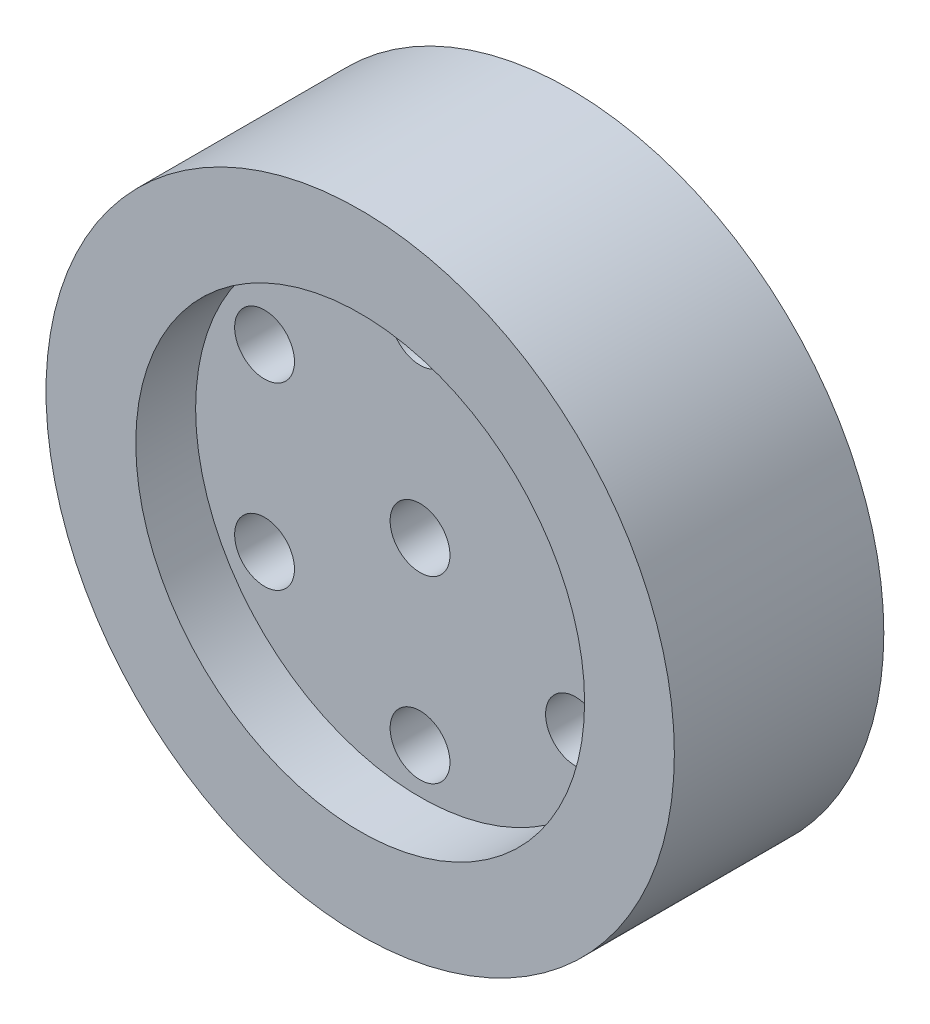
ISO-10303-21;
HEADER;
FILE_DESCRIPTION(('STEP AP214'),'2;1');
FILE_NAME('part.step','',(''),(''),'','','');
FILE_SCHEMA(('AUTOMOTIVE_DESIGN { 1 0 10303 214 1 1 1 1 }'));
ENDSEC;
DATA;
#1=APPLICATION_CONTEXT('core data for automotive mechanical design processes');
#2=APPLICATION_PROTOCOL_DEFINITION('international standard','automotive_design',2000,#1);
#3=PRODUCT_CONTEXT('',#1,'mechanical');
#4=PRODUCT('Part','Part','',(#3));
#5=PRODUCT_RELATED_PRODUCT_CATEGORY('part','',(#4));
#6=PRODUCT_DEFINITION_FORMATION('','',#4);
#7=PRODUCT_DEFINITION_CONTEXT('part definition',#1,'design');
#8=PRODUCT_DEFINITION('design','',#6,#7);
#9=PRODUCT_DEFINITION_SHAPE('','',#8);
#10=(LENGTH_UNIT() NAMED_UNIT(*) SI_UNIT(.MILLI.,.METRE.));
#11=(NAMED_UNIT(*) PLANE_ANGLE_UNIT() SI_UNIT($,.RADIAN.));
#12=(NAMED_UNIT(*) SI_UNIT($,.STERADIAN.) SOLID_ANGLE_UNIT());
#13=UNCERTAINTY_MEASURE_WITH_UNIT(LENGTH_MEASURE(1.E-05),#10,'distance_accuracy_value','');
#14=(GEOMETRIC_REPRESENTATION_CONTEXT(3) GLOBAL_UNCERTAINTY_ASSIGNED_CONTEXT((#13)) GLOBAL_UNIT_ASSIGNED_CONTEXT((#10,
#11,#12)) REPRESENTATION_CONTEXT('',''));
#15=CARTESIAN_POINT('',(0.,0.,0.));
#16=DIRECTION('',(0.,0.,1.));
#17=DIRECTION('',(1.,0.,0.));
#18=AXIS2_PLACEMENT_3D('',#15,#16,#17);
#19=CARTESIAN_POINT('',(0.,12.,14.));
#20=DIRECTION('',(0.,0.,-1.));
#21=DIRECTION('',(-1.,0.,0.));
#22=AXIS2_PLACEMENT_3D('',#19,#20,#21);
#23=CYLINDRICAL_SURFACE('',#22,2.);
#24=CARTESIAN_POINT('',(0.,12.,10.));
#25=DIRECTION('',(0.,0.,1.));
#26=DIRECTION('',(1.,0.,0.));
#27=AXIS2_PLACEMENT_3D('',#24,#25,#26);
#28=CIRCLE('',#27,2.);
#29=CARTESIAN_POINT('',(2.,12.,10.));
#30=VERTEX_POINT('',#29);
#31=EDGE_CURVE('E82',#30,#30,#28,.T.);
#32=ORIENTED_EDGE('',*,*,#31,.T.);
#33=EDGE_LOOP('',(#32));
#34=FACE_BOUND('',#33,.T.);
#35=CARTESIAN_POINT('',(0.,12.,4.));
#36=DIRECTION('',(0.,0.,-1.));
#37=DIRECTION('',(-1.,0.,0.));
#38=AXIS2_PLACEMENT_3D('',#35,#36,#37);
#39=CIRCLE('',#38,2.);
#40=CARTESIAN_POINT('',(-2.,12.,4.));
#41=VERTEX_POINT('',#40);
#42=EDGE_CURVE('E67',#41,#41,#39,.T.);
#43=ORIENTED_EDGE('',*,*,#42,.T.);
#44=EDGE_LOOP('',(#43));
#45=FACE_BOUND('',#44,.T.);
#46=ADVANCED_FACE('F35',(#34,#45),#23,.F.);
#47=CARTESIAN_POINT('',(10.3923048454133,5.99999999999998,14.));
#48=DIRECTION('',(0.,0.,-1.));
#49=DIRECTION('',(-1.,0.,0.));
#50=AXIS2_PLACEMENT_3D('',#47,#48,#49);
#51=CYLINDRICAL_SURFACE('',#50,2.);
#52=CARTESIAN_POINT('',(10.3923048454133,5.99999999999998,10.));
#53=DIRECTION('',(0.,0.,1.));
#54=DIRECTION('',(1.,0.,0.));
#55=AXIS2_PLACEMENT_3D('',#52,#53,#54);
#56=CIRCLE('',#55,2.);
#57=CARTESIAN_POINT('',(12.3923048454133,5.99999999999998,10.));
#58=VERTEX_POINT('',#57);
#59=EDGE_CURVE('E77',#58,#58,#56,.T.);
#60=ORIENTED_EDGE('',*,*,#59,.T.);
#61=EDGE_LOOP('',(#60));
#62=FACE_BOUND('',#61,.T.);
#63=CARTESIAN_POINT('',(10.3923048454133,5.99999999999998,4.));
#64=DIRECTION('',(0.,0.,-1.));
#65=DIRECTION('',(-1.,0.,0.));
#66=AXIS2_PLACEMENT_3D('',#63,#64,#65);
#67=CIRCLE('',#66,2.);
#68=CARTESIAN_POINT('',(8.39230484541328,5.99999999999998,4.));
#69=VERTEX_POINT('',#68);
#70=EDGE_CURVE('E137',#69,#69,#67,.T.);
#71=ORIENTED_EDGE('',*,*,#70,.T.);
#72=EDGE_LOOP('',(#71));
#73=FACE_BOUND('',#72,.T.);
#74=ADVANCED_FACE('F184',(#62,#73),#51,.F.);
#75=CARTESIAN_POINT('',(10.3923048454132,-6.00000000000005,14.));
#76=DIRECTION('',(0.,0.,-1.));
#77=DIRECTION('',(-1.,0.,0.));
#78=AXIS2_PLACEMENT_3D('',#75,#76,#77);
#79=CYLINDRICAL_SURFACE('',#78,2.);
#80=CARTESIAN_POINT('',(10.3923048454132,-6.00000000000005,10.));
#81=DIRECTION('',(0.,0.,1.));
#82=DIRECTION('',(1.,0.,0.));
#83=AXIS2_PLACEMENT_3D('',#80,#81,#82);
#84=CIRCLE('',#83,2.);
#85=CARTESIAN_POINT('',(12.3923048454132,-6.00000000000005,10.));
#86=VERTEX_POINT('',#85);
#87=EDGE_CURVE('E74',#86,#86,#84,.T.);
#88=ORIENTED_EDGE('',*,*,#87,.T.);
#89=EDGE_LOOP('',(#88));
#90=FACE_BOUND('',#89,.T.);
#91=CARTESIAN_POINT('',(10.3923048454132,-6.00000000000005,4.));
#92=DIRECTION('',(0.,0.,-1.));
#93=DIRECTION('',(-1.,0.,0.));
#94=AXIS2_PLACEMENT_3D('',#91,#92,#93);
#95=CIRCLE('',#94,2.);
#96=CARTESIAN_POINT('',(8.39230484541324,-6.00000000000005,4.));
#97=VERTEX_POINT('',#96);
#98=EDGE_CURVE('E128',#97,#97,#95,.T.);
#99=ORIENTED_EDGE('',*,*,#98,.T.);
#100=EDGE_LOOP('',(#99));
#101=FACE_BOUND('',#100,.T.);
#102=ADVANCED_FACE('F189',(#90,#101),#79,.F.);
#103=CARTESIAN_POINT('',(0.,-12.,14.));
#104=DIRECTION('',(0.,0.,-1.));
#105=DIRECTION('',(-1.,0.,0.));
#106=AXIS2_PLACEMENT_3D('',#103,#104,#105);
#107=CYLINDRICAL_SURFACE('',#106,2.);
#108=CARTESIAN_POINT('',(0.,-12.,10.));
#109=DIRECTION('',(0.,0.,1.));
#110=DIRECTION('',(1.,0.,0.));
#111=AXIS2_PLACEMENT_3D('',#108,#109,#110);
#112=CIRCLE('',#111,2.);
#113=CARTESIAN_POINT('',(1.99999999999992,-12.,10.));
#114=VERTEX_POINT('',#113);
#115=EDGE_CURVE('E59',#114,#114,#112,.T.);
#116=ORIENTED_EDGE('',*,*,#115,.T.);
#117=EDGE_LOOP('',(#116));
#118=FACE_BOUND('',#117,.T.);
#119=CARTESIAN_POINT('',(0.,-12.,4.));
#120=DIRECTION('',(0.,0.,-1.));
#121=DIRECTION('',(-1.,0.,0.));
#122=AXIS2_PLACEMENT_3D('',#119,#120,#121);
#123=CIRCLE('',#122,2.);
#124=CARTESIAN_POINT('',(-2.00000000000008,-12.,4.));
#125=VERTEX_POINT('',#124);
#126=EDGE_CURVE('E125',#125,#125,#123,.T.);
#127=ORIENTED_EDGE('',*,*,#126,.T.);
#128=EDGE_LOOP('',(#127));
#129=FACE_BOUND('',#128,.T.);
#130=ADVANCED_FACE('F119',(#118,#129),#107,.F.);
#131=CARTESIAN_POINT('',(-10.3923048454133,-5.99999999999991,14.));
#132=DIRECTION('',(0.,0.,-1.));
#133=DIRECTION('',(-1.,0.,0.));
#134=AXIS2_PLACEMENT_3D('',#131,#132,#133);
#135=CYLINDRICAL_SURFACE('',#134,2.);
#136=CARTESIAN_POINT('',(-10.3923048454133,-5.99999999999991,10.));
#137=DIRECTION('',(0.,0.,1.));
#138=DIRECTION('',(1.,0.,0.));
#139=AXIS2_PLACEMENT_3D('',#136,#137,#138);
#140=CIRCLE('',#139,2.);
#141=CARTESIAN_POINT('',(-8.39230484541332,-5.99999999999991,10.));
#142=VERTEX_POINT('',#141);
#143=EDGE_CURVE('E54',#142,#142,#140,.T.);
#144=ORIENTED_EDGE('',*,*,#143,.T.);
#145=EDGE_LOOP('',(#144));
#146=FACE_BOUND('',#145,.T.);
#147=CARTESIAN_POINT('',(-10.3923048454133,-5.99999999999991,4.));
#148=DIRECTION('',(0.,0.,-1.));
#149=DIRECTION('',(-1.,0.,0.));
#150=AXIS2_PLACEMENT_3D('',#147,#148,#149);
#151=CIRCLE('',#150,2.);
#152=CARTESIAN_POINT('',(-12.3923048454133,-5.99999999999991,4.));
#153=VERTEX_POINT('',#152);
#154=EDGE_CURVE('E123',#153,#153,#151,.T.);
#155=ORIENTED_EDGE('',*,*,#154,.T.);
#156=EDGE_LOOP('',(#155));
#157=FACE_BOUND('',#156,.T.);
#158=ADVANCED_FACE('F115',(#146,#157),#135,.F.);
#159=CARTESIAN_POINT('',(-10.3923048454132,6.00000000000012,14.));
#160=DIRECTION('',(0.,0.,-1.));
#161=DIRECTION('',(-1.,0.,0.));
#162=AXIS2_PLACEMENT_3D('',#159,#160,#161);
#163=CYLINDRICAL_SURFACE('',#162,2.);
#164=CARTESIAN_POINT('',(-10.3923048454132,6.00000000000012,10.));
#165=DIRECTION('',(0.,0.,1.));
#166=DIRECTION('',(1.,0.,0.));
#167=AXIS2_PLACEMENT_3D('',#164,#165,#166);
#168=CIRCLE('',#167,2.);
#169=CARTESIAN_POINT('',(-8.3923048454132,6.00000000000012,10.));
#170=VERTEX_POINT('',#169);
#171=EDGE_CURVE('E52',#170,#170,#168,.T.);
#172=ORIENTED_EDGE('',*,*,#171,.T.);
#173=EDGE_LOOP('',(#172));
#174=FACE_BOUND('',#173,.T.);
#175=CARTESIAN_POINT('',(-10.3923048454132,6.00000000000012,4.));
#176=DIRECTION('',(0.,0.,-1.));
#177=DIRECTION('',(-1.,0.,0.));
#178=AXIS2_PLACEMENT_3D('',#175,#176,#177);
#179=CIRCLE('',#178,2.);
#180=CARTESIAN_POINT('',(-12.3923048454132,6.00000000000012,4.));
#181=VERTEX_POINT('',#180);
#182=EDGE_CURVE('E39',#181,#181,#179,.T.);
#183=ORIENTED_EDGE('',*,*,#182,.T.);
#184=EDGE_LOOP('',(#183));
#185=FACE_BOUND('',#184,.T.);
#186=ADVANCED_FACE('F118',(#174,#185),#163,.F.);
#187=CARTESIAN_POINT('',(0.,0.,0.));
#188=DIRECTION('',(0.,0.,1.));
#189=DIRECTION('',(1.,0.,0.));
#190=AXIS2_PLACEMENT_3D('',#187,#188,#189);
#191=PLANE('',#190);
#192=CARTESIAN_POINT('',(0.,0.,0.));
#193=DIRECTION('',(0.,0.,1.));
#194=DIRECTION('',(1.,0.,0.));
#195=AXIS2_PLACEMENT_3D('',#192,#193,#194);
#196=CIRCLE('',#195,2.);
#197=CARTESIAN_POINT('',(2.,0.,0.));
#198=VERTEX_POINT('',#197);
#199=EDGE_CURVE('E48',#198,#198,#196,.T.);
#200=ORIENTED_EDGE('',*,*,#199,.T.);
#201=EDGE_LOOP('',(#200));
#202=FACE_BOUND('',#201,.T.);
#203=CARTESIAN_POINT('',(0.,0.,0.));
#204=DIRECTION('',(0.,0.,-1.));
#205=DIRECTION('',(-1.,0.,0.));
#206=AXIS2_PLACEMENT_3D('',#203,#204,#205);
#207=CIRCLE('',#206,5.);
#208=CARTESIAN_POINT('',(-5.,0.,0.));
#209=VERTEX_POINT('',#208);
#210=EDGE_CURVE('E166',#209,#209,#207,.T.);
#211=ORIENTED_EDGE('',*,*,#210,.T.);
#212=EDGE_LOOP('',(#211));
#213=FACE_BOUND('',#212,.T.);
#214=ADVANCED_FACE('F89',(#202,#213),#191,.F.);
#215=CARTESIAN_POINT('',(0.,0.,14.));
#216=DIRECTION('',(0.,0.,-1.));
#217=DIRECTION('',(-1.,0.,0.));
#218=AXIS2_PLACEMENT_3D('',#215,#216,#217);
#219=CYLINDRICAL_SURFACE('',#218,2.);
#220=ORIENTED_EDGE('',*,*,#199,.F.);
#221=EDGE_LOOP('',(#220));
#222=FACE_BOUND('',#221,.T.);
#223=CARTESIAN_POINT('',(0.,0.,10.));
#224=DIRECTION('',(0.,0.,1.));
#225=DIRECTION('',(1.,0.,0.));
#226=AXIS2_PLACEMENT_3D('',#223,#224,#225);
#227=CIRCLE('',#226,2.);
#228=CARTESIAN_POINT('',(2.,0.,10.));
#229=VERTEX_POINT('',#228);
#230=EDGE_CURVE('E80',#229,#229,#227,.T.);
#231=ORIENTED_EDGE('',*,*,#230,.T.);
#232=EDGE_LOOP('',(#231));
#233=FACE_BOUND('',#232,.T.);
#234=ADVANCED_FACE('F92',(#222,#233),#219,.F.);
#235=CARTESIAN_POINT('',(0.,0.,14.));
#236=DIRECTION('',(0.,0.,1.));
#237=DIRECTION('',(1.,0.,0.));
#238=AXIS2_PLACEMENT_3D('',#235,#236,#237);
#239=PLANE('',#238);
#240=CARTESIAN_POINT('',(0.,0.,14.));
#241=DIRECTION('',(0.,0.,1.));
#242=DIRECTION('',(1.,0.,0.));
#243=AXIS2_PLACEMENT_3D('',#240,#241,#242);
#244=CIRCLE('',#243,15.);
#245=CARTESIAN_POINT('',(15.,0.,14.));
#246=VERTEX_POINT('',#245);
#247=EDGE_CURVE('E62',#246,#246,#244,.T.);
#248=ORIENTED_EDGE('',*,*,#247,.F.);
#249=EDGE_LOOP('',(#248));
#250=FACE_BOUND('',#249,.T.);
#251=CARTESIAN_POINT('',(0.,0.,14.));
#252=DIRECTION('',(0.,0.,1.));
#253=DIRECTION('',(1.,0.,0.));
#254=AXIS2_PLACEMENT_3D('',#251,#252,#253);
#255=CIRCLE('',#254,21.);
#256=CARTESIAN_POINT('',(21.,0.,14.));
#257=VERTEX_POINT('',#256);
#258=EDGE_CURVE('E10',#257,#257,#255,.T.);
#259=ORIENTED_EDGE('',*,*,#258,.T.);
#260=EDGE_LOOP('',(#259));
#261=FACE_BOUND('',#260,.T.);
#262=ADVANCED_FACE('F95',(#250,#261),#239,.T.);
#263=CARTESIAN_POINT('',(0.,0.,0.));
#264=DIRECTION('',(0.,0.,-1.));
#265=DIRECTION('',(-1.,0.,0.));
#266=AXIS2_PLACEMENT_3D('',#263,#264,#265);
#267=CIRCLE('',#266,15.);
#268=CARTESIAN_POINT('',(-15.,0.,0.));
#269=VERTEX_POINT('',#268);
#270=EDGE_CURVE('E133',#269,#269,#267,.T.);
#271=ORIENTED_EDGE('',*,*,#270,.F.);
#272=EDGE_LOOP('',(#271));
#273=FACE_BOUND('',#272,.T.);
#274=CARTESIAN_POINT('',(0.,0.,0.));
#275=DIRECTION('',(0.,0.,1.));
#276=DIRECTION('',(1.,0.,0.));
#277=AXIS2_PLACEMENT_3D('',#274,#275,#276);
#278=CIRCLE('',#277,21.);
#279=CARTESIAN_POINT('',(21.,0.,0.));
#280=VERTEX_POINT('',#279);
#281=EDGE_CURVE('E43',#280,#280,#278,.T.);
#282=ORIENTED_EDGE('',*,*,#281,.F.);
#283=EDGE_LOOP('',(#282));
#284=FACE_BOUND('',#283,.T.);
#285=ADVANCED_FACE('F175',(#273,#284),#191,.F.);
#286=CARTESIAN_POINT('',(0.,0.,14.));
#287=DIRECTION('',(0.,0.,-1.));
#288=DIRECTION('',(-1.,0.,0.));
#289=AXIS2_PLACEMENT_3D('',#286,#287,#288);
#290=CYLINDRICAL_SURFACE('',#289,21.);
#291=ORIENTED_EDGE('',*,*,#258,.F.);
#292=EDGE_LOOP('',(#291));
#293=FACE_BOUND('',#292,.T.);
#294=ORIENTED_EDGE('',*,*,#281,.T.);
#295=EDGE_LOOP('',(#294));
#296=FACE_BOUND('',#295,.T.);
#297=ADVANCED_FACE('F37',(#293,#296),#290,.T.);
#298=CARTESIAN_POINT('',(0.,0.,10.));
#299=DIRECTION('',(0.,0.,1.));
#300=DIRECTION('',(1.,0.,0.));
#301=AXIS2_PLACEMENT_3D('',#298,#299,#300);
#302=CYLINDRICAL_SURFACE('',#301,15.);
#303=CARTESIAN_POINT('',(0.,0.,10.));
#304=DIRECTION('',(0.,0.,1.));
#305=DIRECTION('',(1.,0.,0.));
#306=AXIS2_PLACEMENT_3D('',#303,#304,#305);
#307=CIRCLE('',#306,15.);
#308=CARTESIAN_POINT('',(15.,0.,10.));
#309=VERTEX_POINT('',#308);
#310=EDGE_CURVE('E55',#309,#309,#307,.T.);
#311=ORIENTED_EDGE('',*,*,#310,.F.);
#312=EDGE_LOOP('',(#311));
#313=FACE_BOUND('',#312,.T.);
#314=ORIENTED_EDGE('',*,*,#247,.T.);
#315=EDGE_LOOP('',(#314));
#316=FACE_BOUND('',#315,.T.);
#317=ADVANCED_FACE('F103',(#313,#316),#302,.F.);
#318=CARTESIAN_POINT('',(0.,0.,10.));
#319=DIRECTION('',(0.,0.,1.));
#320=DIRECTION('',(1.,0.,0.));
#321=AXIS2_PLACEMENT_3D('',#318,#319,#320);
#322=PLANE('',#321);
#323=ORIENTED_EDGE('',*,*,#31,.F.);
#324=EDGE_LOOP('',(#323));
#325=FACE_BOUND('',#324,.T.);
#326=ORIENTED_EDGE('',*,*,#230,.F.);
#327=EDGE_LOOP('',(#326));
#328=FACE_BOUND('',#327,.T.);
#329=ORIENTED_EDGE('',*,*,#59,.F.);
#330=EDGE_LOOP('',(#329));
#331=FACE_BOUND('',#330,.T.);
#332=ORIENTED_EDGE('',*,*,#87,.F.);
#333=EDGE_LOOP('',(#332));
#334=FACE_BOUND('',#333,.T.);
#335=ORIENTED_EDGE('',*,*,#115,.F.);
#336=EDGE_LOOP('',(#335));
#337=FACE_BOUND('',#336,.T.);
#338=ORIENTED_EDGE('',*,*,#143,.F.);
#339=EDGE_LOOP('',(#338));
#340=FACE_BOUND('',#339,.T.);
#341=ORIENTED_EDGE('',*,*,#171,.F.);
#342=EDGE_LOOP('',(#341));
#343=FACE_BOUND('',#342,.T.);
#344=ORIENTED_EDGE('',*,*,#310,.T.);
#345=EDGE_LOOP('',(#344));
#346=FACE_BOUND('',#345,.T.);
#347=ADVANCED_FACE('F99',(#325,#328,#331,#334,#337,#340,#343,#346),#322,.T.);
#348=CARTESIAN_POINT('',(0.,0.,4.));
#349=DIRECTION('',(0.,0.,-1.));
#350=DIRECTION('',(-1.,0.,0.));
#351=AXIS2_PLACEMENT_3D('',#348,#349,#350);
#352=CYLINDRICAL_SURFACE('',#351,15.);
#353=CARTESIAN_POINT('',(0.,0.,4.));
#354=DIRECTION('',(0.,0.,-1.));
#355=DIRECTION('',(-1.,0.,0.));
#356=AXIS2_PLACEMENT_3D('',#353,#354,#355);
#357=CIRCLE('',#356,15.);
#358=CARTESIAN_POINT('',(-15.,0.,4.));
#359=VERTEX_POINT('',#358);
#360=EDGE_CURVE('E131',#359,#359,#357,.T.);
#361=ORIENTED_EDGE('',*,*,#360,.F.);
#362=EDGE_LOOP('',(#361));
#363=FACE_BOUND('',#362,.T.);
#364=ORIENTED_EDGE('',*,*,#270,.T.);
#365=EDGE_LOOP('',(#364));
#366=FACE_BOUND('',#365,.T.);
#367=ADVANCED_FACE('F102',(#363,#366),#352,.F.);
#368=CARTESIAN_POINT('',(0.,0.,4.));
#369=DIRECTION('',(0.,0.,-1.));
#370=DIRECTION('',(-1.,0.,0.));
#371=AXIS2_PLACEMENT_3D('',#368,#369,#370);
#372=PLANE('',#371);
#373=ORIENTED_EDGE('',*,*,#42,.F.);
#374=EDGE_LOOP('',(#373));
#375=FACE_BOUND('',#374,.T.);
#376=ORIENTED_EDGE('',*,*,#70,.F.);
#377=EDGE_LOOP('',(#376));
#378=FACE_BOUND('',#377,.T.);
#379=ORIENTED_EDGE('',*,*,#98,.F.);
#380=EDGE_LOOP('',(#379));
#381=FACE_BOUND('',#380,.T.);
#382=ORIENTED_EDGE('',*,*,#126,.F.);
#383=EDGE_LOOP('',(#382));
#384=FACE_BOUND('',#383,.T.);
#385=ORIENTED_EDGE('',*,*,#154,.F.);
#386=EDGE_LOOP('',(#385));
#387=FACE_BOUND('',#386,.T.);
#388=ORIENTED_EDGE('',*,*,#182,.F.);
#389=EDGE_LOOP('',(#388));
#390=FACE_BOUND('',#389,.T.);
#391=CARTESIAN_POINT('',(0.,0.,4.));
#392=DIRECTION('',(0.,0.,-1.));
#393=DIRECTION('',(-1.,0.,0.));
#394=AXIS2_PLACEMENT_3D('',#391,#392,#393);
#395=CIRCLE('',#394,5.);
#396=CARTESIAN_POINT('',(-5.,0.,4.));
#397=VERTEX_POINT('',#396);
#398=EDGE_CURVE('E160',#397,#397,#395,.T.);
#399=ORIENTED_EDGE('',*,*,#398,.F.);
#400=EDGE_LOOP('',(#399));
#401=FACE_BOUND('',#400,.T.);
#402=ORIENTED_EDGE('',*,*,#360,.T.);
#403=EDGE_LOOP('',(#402));
#404=FACE_BOUND('',#403,.T.);
#405=ADVANCED_FACE('F145',(#375,#378,#381,#384,#387,#390,#401,#404),#372,.T.);
#406=CARTESIAN_POINT('',(0.,0.,4.));
#407=DIRECTION('',(0.,0.,-1.));
#408=DIRECTION('',(-1.,0.,0.));
#409=AXIS2_PLACEMENT_3D('',#406,#407,#408);
#410=CYLINDRICAL_SURFACE('',#409,5.);
#411=ORIENTED_EDGE('',*,*,#398,.T.);
#412=EDGE_LOOP('',(#411));
#413=FACE_BOUND('',#412,.T.);
#414=ORIENTED_EDGE('',*,*,#210,.F.);
#415=EDGE_LOOP('',(#414));
#416=FACE_BOUND('',#415,.T.);
#417=ADVANCED_FACE('F148',(#413,#416),#410,.T.);
#418=CLOSED_SHELL('',(#46,#74,#102,#130,#158,#186,#214,#234,#262,#285,#297,#317,#347,#367,#405,#417));
#419=MANIFOLD_SOLID_BREP('B2',#418);
#420=ADVANCED_BREP_SHAPE_REPRESENTATION('',(#18,#419),#14);
#421=SHAPE_DEFINITION_REPRESENTATION(#9,#420);
ENDSEC;
END-ISO-10303-21;
